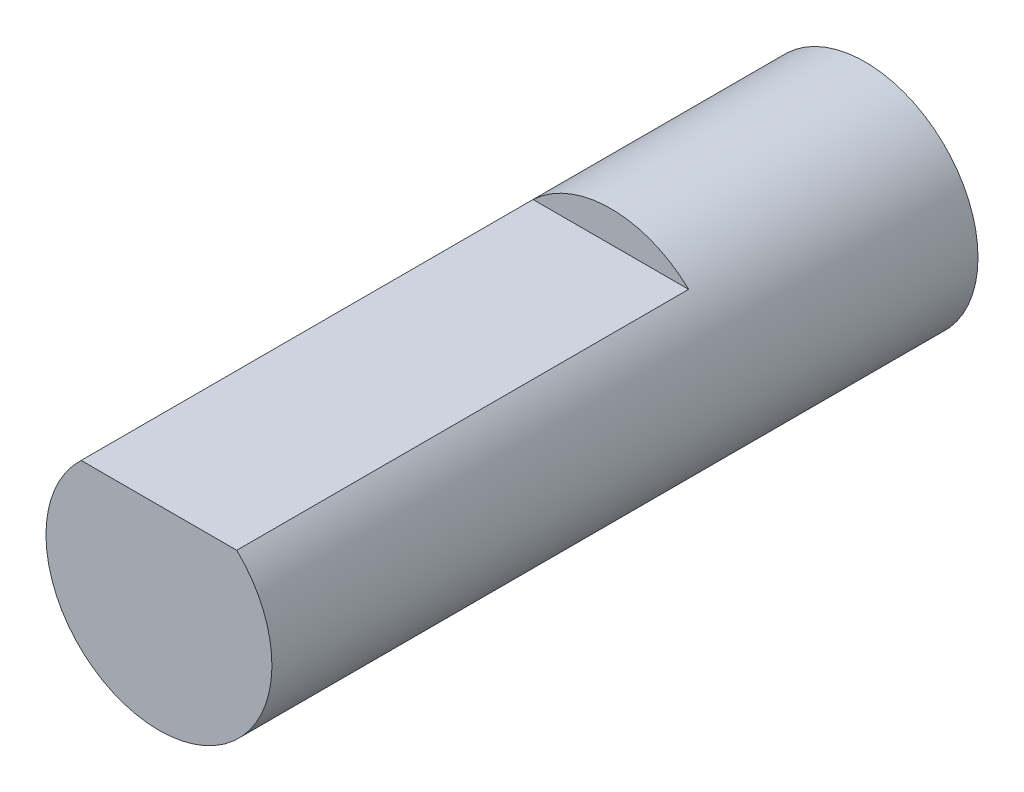
ISO-10303-21;
HEADER;
FILE_DESCRIPTION(('STEP AP214'),'2;1');
FILE_NAME('part.step','',(''),(''),'','','');
FILE_SCHEMA(('AUTOMOTIVE_DESIGN { 1 0 10303 214 1 1 1 1 }'));
ENDSEC;
DATA;
#1=APPLICATION_CONTEXT('core data for automotive mechanical design processes');
#2=APPLICATION_PROTOCOL_DEFINITION('international standard','automotive_design',2000,#1);
#3=PRODUCT_CONTEXT('',#1,'mechanical');
#4=PRODUCT('Part','Part','',(#3));
#5=PRODUCT_RELATED_PRODUCT_CATEGORY('part','',(#4));
#6=PRODUCT_DEFINITION_FORMATION('','',#4);
#7=PRODUCT_DEFINITION_CONTEXT('part definition',#1,'design');
#8=PRODUCT_DEFINITION('design','',#6,#7);
#9=PRODUCT_DEFINITION_SHAPE('','',#8);
#10=(LENGTH_UNIT() NAMED_UNIT(*) SI_UNIT(.MILLI.,.METRE.));
#11=(NAMED_UNIT(*) PLANE_ANGLE_UNIT() SI_UNIT($,.RADIAN.));
#12=(NAMED_UNIT(*) SI_UNIT($,.STERADIAN.) SOLID_ANGLE_UNIT());
#13=UNCERTAINTY_MEASURE_WITH_UNIT(LENGTH_MEASURE(1.E-05),#10,'distance_accuracy_value','');
#14=(GEOMETRIC_REPRESENTATION_CONTEXT(3) GLOBAL_UNCERTAINTY_ASSIGNED_CONTEXT((#13)) GLOBAL_UNIT_ASSIGNED_CONTEXT((#10,
#11,#12)) REPRESENTATION_CONTEXT('',''));
#15=CARTESIAN_POINT('',(0.,0.,0.));
#16=DIRECTION('',(0.,0.,1.));
#17=DIRECTION('',(1.,0.,0.));
#18=AXIS2_PLACEMENT_3D('',#15,#16,#17);
#19=CARTESIAN_POINT('',(0.,0.,12.5));
#20=DIRECTION('',(0.,0.,-1.));
#21=DIRECTION('',(-1.,0.,0.));
#22=AXIS2_PLACEMENT_3D('',#19,#20,#21);
#23=CYLINDRICAL_SURFACE('',#22,2.);
#24=CARTESIAN_POINT('',(0.,0.,12.5));
#25=DIRECTION('',(0.,0.,1.));
#26=DIRECTION('',(1.,0.,0.));
#27=AXIS2_PLACEMENT_3D('',#24,#25,#26);
#28=CIRCLE('',#27,2.);
#29=CARTESIAN_POINT('',(-1.37749773139559,1.45,12.5));
#30=VERTEX_POINT('',#29);
#31=CARTESIAN_POINT('',(1.37749773139559,1.45,12.5));
#32=VERTEX_POINT('',#31);
#33=EDGE_CURVE('E11',#30,#32,#28,.T.);
#34=ORIENTED_EDGE('',*,*,#33,.F.);
#35=DIRECTION('',(0.,0.,1.));
#36=VECTOR('',#35,1.);
#37=CARTESIAN_POINT('',(-1.37749773139559,1.45,4.5));
#38=LINE('',#37,#36);
#39=CARTESIAN_POINT('',(-1.37749773139559,1.45,4.5));
#40=VERTEX_POINT('',#39);
#41=EDGE_CURVE('E47',#40,#30,#38,.T.);
#42=ORIENTED_EDGE('',*,*,#41,.F.);
#43=CARTESIAN_POINT('',(0.,0.,4.5));
#44=DIRECTION('',(0.,0.,1.));
#45=DIRECTION('',(1.,0.,0.));
#46=AXIS2_PLACEMENT_3D('',#43,#44,#45);
#47=CIRCLE('',#46,2.);
#48=CARTESIAN_POINT('',(1.37749773139559,1.45,4.5));
#49=VERTEX_POINT('',#48);
#50=EDGE_CURVE('E62',#49,#40,#47,.T.);
#51=ORIENTED_EDGE('',*,*,#50,.F.);
#52=DIRECTION('',(0.,0.,1.));
#53=VECTOR('',#52,1.);
#54=CARTESIAN_POINT('',(1.37749773139559,1.45,4.5));
#55=LINE('',#54,#53);
#56=EDGE_CURVE('E53',#49,#32,#55,.T.);
#57=ORIENTED_EDGE('',*,*,#56,.T.);
#58=EDGE_LOOP('',(#34,#42,#51,#57));
#59=FACE_BOUND('',#58,.T.);
#60=CARTESIAN_POINT('',(0.,0.,0.));
#61=DIRECTION('',(0.,0.,1.));
#62=DIRECTION('',(1.,0.,0.));
#63=AXIS2_PLACEMENT_3D('',#60,#61,#62);
#64=CIRCLE('',#63,2.);
#65=CARTESIAN_POINT('',(2.,0.,0.));
#66=VERTEX_POINT('',#65);
#67=EDGE_CURVE('E36',#66,#66,#64,.T.);
#68=ORIENTED_EDGE('',*,*,#67,.T.);
#69=EDGE_LOOP('',(#68));
#70=FACE_BOUND('',#69,.T.);
#71=ADVANCED_FACE('F33',(#59,#70),#23,.T.);
#72=CARTESIAN_POINT('',(0.,0.,12.5));
#73=DIRECTION('',(0.,0.,1.));
#74=DIRECTION('',(1.,0.,0.));
#75=AXIS2_PLACEMENT_3D('',#72,#73,#74);
#76=PLANE('',#75);
#77=DIRECTION('',(1.,0.,0.));
#78=VECTOR('',#77,1.);
#79=CARTESIAN_POINT('',(-1.37749773139559,1.45,12.5));
#80=LINE('',#79,#78);
#81=EDGE_CURVE('E58',#30,#32,#80,.T.);
#82=ORIENTED_EDGE('',*,*,#81,.F.);
#83=ORIENTED_EDGE('',*,*,#33,.T.);
#84=EDGE_LOOP('',(#82,#83));
#85=FACE_BOUND('',#84,.T.);
#86=ADVANCED_FACE('F68',(#85),#76,.T.);
#87=CARTESIAN_POINT('',(0.,0.,0.));
#88=DIRECTION('',(0.,0.,1.));
#89=DIRECTION('',(1.,0.,0.));
#90=AXIS2_PLACEMENT_3D('',#87,#88,#89);
#91=PLANE('',#90);
#92=ORIENTED_EDGE('',*,*,#67,.F.);
#93=EDGE_LOOP('',(#92));
#94=FACE_BOUND('',#93,.T.);
#95=ADVANCED_FACE('F70',(#94),#91,.F.);
#96=CARTESIAN_POINT('',(-1.37749773139559,1.45,4.5));
#97=DIRECTION('',(0.,-1.,0.));
#98=DIRECTION('',(0.,0.,-1.));
#99=AXIS2_PLACEMENT_3D('',#96,#97,#98);
#100=PLANE('',#99);
#101=ORIENTED_EDGE('',*,*,#81,.T.);
#102=ORIENTED_EDGE('',*,*,#56,.F.);
#103=DIRECTION('',(1.,0.,0.));
#104=VECTOR('',#103,1.);
#105=CARTESIAN_POINT('',(-1.37749773139559,1.45,4.5));
#106=LINE('',#105,#104);
#107=EDGE_CURVE('E85',#40,#49,#106,.T.);
#108=ORIENTED_EDGE('',*,*,#107,.F.);
#109=ORIENTED_EDGE('',*,*,#41,.T.);
#110=EDGE_LOOP('',(#101,#102,#108,#109));
#111=FACE_BOUND('',#110,.T.);
#112=ADVANCED_FACE('F59',(#111),#100,.F.);
#113=CARTESIAN_POINT('',(0.,0.,4.5));
#114=DIRECTION('',(0.,0.,1.));
#115=DIRECTION('',(1.,0.,0.));
#116=AXIS2_PLACEMENT_3D('',#113,#114,#115);
#117=PLANE('',#116);
#118=ORIENTED_EDGE('',*,*,#50,.T.);
#119=ORIENTED_EDGE('',*,*,#107,.T.);
#120=EDGE_LOOP('',(#118,#119));
#121=FACE_BOUND('',#120,.T.);
#122=ADVANCED_FACE('F80',(#121),#117,.T.);
#123=CLOSED_SHELL('',(#71,#86,#95,#112,#122));
#124=MANIFOLD_SOLID_BREP('B2',#123);
#125=ADVANCED_BREP_SHAPE_REPRESENTATION('',(#18,#124),#14);
#126=SHAPE_DEFINITION_REPRESENTATION(#9,#125);
ENDSEC;
END-ISO-10303-21;
